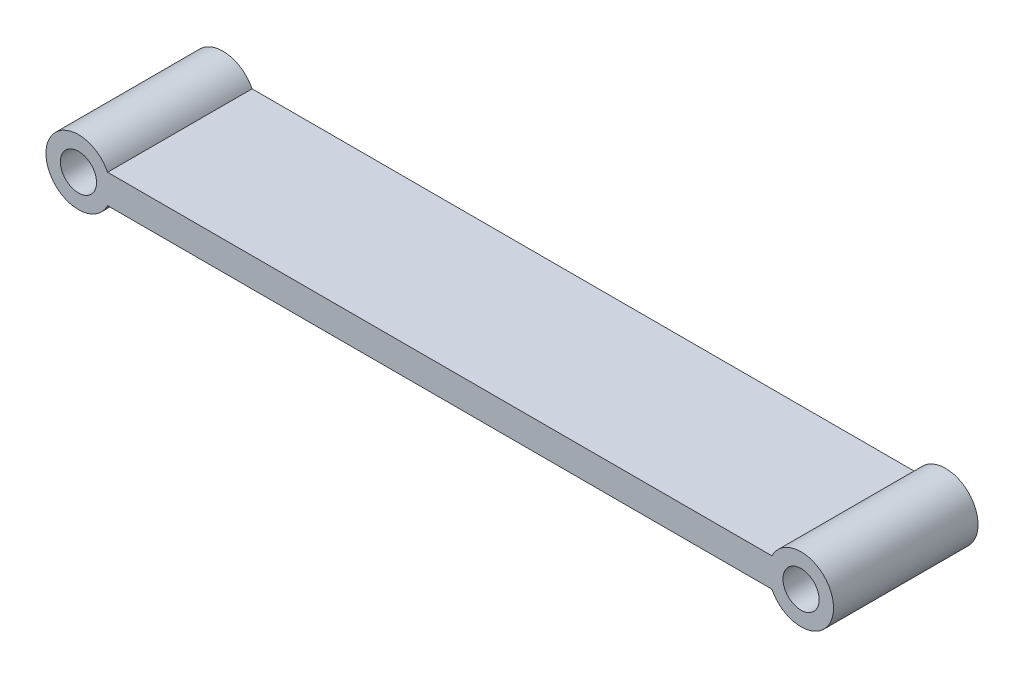
ISO-10303-21;
HEADER;
FILE_DESCRIPTION(('STEP AP214'),'2;1');
FILE_NAME('part.step','',(''),(''),'','','');
FILE_SCHEMA(('AUTOMOTIVE_DESIGN { 1 0 10303 214 1 1 1 1 }'));
ENDSEC;
DATA;
#1=APPLICATION_CONTEXT('core data for automotive mechanical design processes');
#2=APPLICATION_PROTOCOL_DEFINITION('international standard','automotive_design',2000,#1);
#3=PRODUCT_CONTEXT('',#1,'mechanical');
#4=PRODUCT('Part','Part','',(#3));
#5=PRODUCT_RELATED_PRODUCT_CATEGORY('part','',(#4));
#6=PRODUCT_DEFINITION_FORMATION('','',#4);
#7=PRODUCT_DEFINITION_CONTEXT('part definition',#1,'design');
#8=PRODUCT_DEFINITION('design','',#6,#7);
#9=PRODUCT_DEFINITION_SHAPE('','',#8);
#10=(LENGTH_UNIT() NAMED_UNIT(*) SI_UNIT(.MILLI.,.METRE.));
#11=(NAMED_UNIT(*) PLANE_ANGLE_UNIT() SI_UNIT($,.RADIAN.));
#12=(NAMED_UNIT(*) SI_UNIT($,.STERADIAN.) SOLID_ANGLE_UNIT());
#13=UNCERTAINTY_MEASURE_WITH_UNIT(LENGTH_MEASURE(1.E-05),#10,'distance_accuracy_value','');
#14=(GEOMETRIC_REPRESENTATION_CONTEXT(3) GLOBAL_UNCERTAINTY_ASSIGNED_CONTEXT((#13)) GLOBAL_UNIT_ASSIGNED_CONTEXT((#10,
#11,#12)) REPRESENTATION_CONTEXT('',''));
#15=CARTESIAN_POINT('',(0.,0.,0.));
#16=DIRECTION('',(0.,0.,1.));
#17=DIRECTION('',(1.,0.,0.));
#18=AXIS2_PLACEMENT_3D('',#15,#16,#17);
#19=CARTESIAN_POINT('',(0.,0.,12.7));
#20=DIRECTION('',(0.,0.,1.));
#21=DIRECTION('',(1.,0.,0.));
#22=AXIS2_PLACEMENT_3D('',#19,#20,#21);
#23=PLANE('',#22);
#24=CARTESIAN_POINT('',(0.,0.,12.7));
#25=DIRECTION('',(0.,0.,1.));
#26=DIRECTION('',(1.,0.,0.));
#27=AXIS2_PLACEMENT_3D('',#24,#25,#26);
#28=CIRCLE('',#27,3.175);
#29=CARTESIAN_POINT('',(3.175,0.,12.7));
#30=VERTEX_POINT('',#29);
#31=EDGE_CURVE('E100',#30,#30,#28,.T.);
#32=ORIENTED_EDGE('',*,*,#31,.F.);
#33=EDGE_LOOP('',(#32));
#34=FACE_BOUND('',#33,.T.);
#35=CARTESIAN_POINT('',(0.,0.,12.7));
#36=DIRECTION('',(0.,0.,1.));
#37=DIRECTION('',(1.,0.,0.));
#38=AXIS2_PLACEMENT_3D('',#35,#36,#37);
#39=CIRCLE('',#38,5.715);
#40=CARTESIAN_POINT('',(5.11953367016958,2.54,12.7));
#41=VERTEX_POINT('',#40);
#42=CARTESIAN_POINT('',(5.11953367016958,-2.54,12.7));
#43=VERTEX_POINT('',#42);
#44=EDGE_CURVE('E85',#41,#43,#39,.T.);
#45=ORIENTED_EDGE('',*,*,#44,.T.);
#46=DIRECTION('',(1.,0.,0.));
#47=VECTOR('',#46,1.);
#48=CARTESIAN_POINT('',(5.11953367016958,-2.54,12.7));
#49=LINE('',#48,#47);
#50=CARTESIAN_POINT('',(121.88046632983,-2.54,12.7));
#51=VERTEX_POINT('',#50);
#52=EDGE_CURVE('E80',#43,#51,#49,.T.);
#53=ORIENTED_EDGE('',*,*,#52,.T.);
#54=CARTESIAN_POINT('',(127.,0.,12.7));
#55=DIRECTION('',(0.,0.,1.));
#56=DIRECTION('',(1.,0.,0.));
#57=AXIS2_PLACEMENT_3D('',#54,#55,#56);
#58=CIRCLE('',#57,5.715);
#59=CARTESIAN_POINT('',(121.88046632983,2.54,12.7));
#60=VERTEX_POINT('',#59);
#61=EDGE_CURVE('E83',#51,#60,#58,.T.);
#62=ORIENTED_EDGE('',*,*,#61,.T.);
#63=DIRECTION('',(-1.,0.,0.));
#64=VECTOR('',#63,1.);
#65=CARTESIAN_POINT('',(5.11953367016958,2.54,12.7));
#66=LINE('',#65,#64);
#67=EDGE_CURVE('E50',#60,#41,#66,.T.);
#68=ORIENTED_EDGE('',*,*,#67,.T.);
#69=EDGE_LOOP('',(#45,#53,#62,#68));
#70=FACE_BOUND('',#69,.T.);
#71=CARTESIAN_POINT('',(127.,0.,12.7));
#72=DIRECTION('',(0.,0.,1.));
#73=DIRECTION('',(1.,0.,0.));
#74=AXIS2_PLACEMENT_3D('',#71,#72,#73);
#75=CIRCLE('',#74,3.175);
#76=CARTESIAN_POINT('',(130.175,0.,12.7));
#77=VERTEX_POINT('',#76);
#78=EDGE_CURVE('E115',#77,#77,#75,.T.);
#79=ORIENTED_EDGE('',*,*,#78,.F.);
#80=EDGE_LOOP('',(#79));
#81=FACE_BOUND('',#80,.T.);
#82=ADVANCED_FACE('F33',(#34,#70,#81),#23,.T.);
#83=CARTESIAN_POINT('',(0.,0.,-12.7));
#84=DIRECTION('',(0.,0.,1.));
#85=DIRECTION('',(1.,0.,0.));
#86=AXIS2_PLACEMENT_3D('',#83,#84,#85);
#87=PLANE('',#86);
#88=CARTESIAN_POINT('',(0.,0.,-12.7));
#89=DIRECTION('',(0.,0.,1.));
#90=DIRECTION('',(1.,0.,0.));
#91=AXIS2_PLACEMENT_3D('',#88,#89,#90);
#92=CIRCLE('',#91,5.715);
#93=CARTESIAN_POINT('',(5.11953367016958,2.54,-12.7));
#94=VERTEX_POINT('',#93);
#95=CARTESIAN_POINT('',(5.11953367016958,-2.54,-12.7));
#96=VERTEX_POINT('',#95);
#97=EDGE_CURVE('E97',#94,#96,#92,.T.);
#98=ORIENTED_EDGE('',*,*,#97,.F.);
#99=DIRECTION('',(-1.,0.,0.));
#100=VECTOR('',#99,1.);
#101=CARTESIAN_POINT('',(5.11953367016958,2.54,-12.7));
#102=LINE('',#101,#100);
#103=CARTESIAN_POINT('',(121.88046632983,2.54,-12.7));
#104=VERTEX_POINT('',#103);
#105=EDGE_CURVE('E73',#104,#94,#102,.T.);
#106=ORIENTED_EDGE('',*,*,#105,.F.);
#107=CARTESIAN_POINT('',(127.,0.,-12.7));
#108=DIRECTION('',(0.,0.,1.));
#109=DIRECTION('',(1.,0.,0.));
#110=AXIS2_PLACEMENT_3D('',#107,#108,#109);
#111=CIRCLE('',#110,5.715);
#112=CARTESIAN_POINT('',(121.88046632983,-2.54,-12.7));
#113=VERTEX_POINT('',#112);
#114=EDGE_CURVE('E67',#113,#104,#111,.T.);
#115=ORIENTED_EDGE('',*,*,#114,.F.);
#116=DIRECTION('',(1.,0.,0.));
#117=VECTOR('',#116,1.);
#118=CARTESIAN_POINT('',(5.11953367016958,-2.54,-12.7));
#119=LINE('',#118,#117);
#120=EDGE_CURVE('E89',#96,#113,#119,.T.);
#121=ORIENTED_EDGE('',*,*,#120,.F.);
#122=EDGE_LOOP('',(#98,#106,#115,#121));
#123=FACE_BOUND('',#122,.T.);
#124=CARTESIAN_POINT('',(0.,0.,-12.7));
#125=DIRECTION('',(0.,0.,1.));
#126=DIRECTION('',(1.,0.,0.));
#127=AXIS2_PLACEMENT_3D('',#124,#125,#126);
#128=CIRCLE('',#127,3.175);
#129=CARTESIAN_POINT('',(3.175,0.,-12.7));
#130=VERTEX_POINT('',#129);
#131=EDGE_CURVE('E112',#130,#130,#128,.T.);
#132=ORIENTED_EDGE('',*,*,#131,.T.);
#133=EDGE_LOOP('',(#132));
#134=FACE_BOUND('',#133,.T.);
#135=CARTESIAN_POINT('',(127.,0.,-12.7));
#136=DIRECTION('',(0.,0.,1.));
#137=DIRECTION('',(1.,0.,0.));
#138=AXIS2_PLACEMENT_3D('',#135,#136,#137);
#139=CIRCLE('',#138,3.175);
#140=CARTESIAN_POINT('',(130.175,0.,-12.7));
#141=VERTEX_POINT('',#140);
#142=EDGE_CURVE('E118',#141,#141,#139,.T.);
#143=ORIENTED_EDGE('',*,*,#142,.T.);
#144=EDGE_LOOP('',(#143));
#145=FACE_BOUND('',#144,.T.);
#146=ADVANCED_FACE('F108',(#123,#134,#145),#87,.F.);
#147=CARTESIAN_POINT('',(0.,0.,12.7));
#148=DIRECTION('',(0.,0.,-1.));
#149=DIRECTION('',(-1.,0.,0.));
#150=AXIS2_PLACEMENT_3D('',#147,#148,#149);
#151=CYLINDRICAL_SURFACE('',#150,5.715);
#152=ORIENTED_EDGE('',*,*,#97,.T.);
#153=DIRECTION('',(0.,0.,-1.));
#154=VECTOR('',#153,1.);
#155=CARTESIAN_POINT('',(5.11953367016958,-2.54,12.7));
#156=LINE('',#155,#154);
#157=EDGE_CURVE('E11',#43,#96,#156,.T.);
#158=ORIENTED_EDGE('',*,*,#157,.F.);
#159=ORIENTED_EDGE('',*,*,#44,.F.);
#160=DIRECTION('',(0.,0.,-1.));
#161=VECTOR('',#160,1.);
#162=CARTESIAN_POINT('',(5.11953367016958,2.54,12.7));
#163=LINE('',#162,#161);
#164=EDGE_CURVE('E93',#41,#94,#163,.T.);
#165=ORIENTED_EDGE('',*,*,#164,.T.);
#166=EDGE_LOOP('',(#152,#158,#159,#165));
#167=FACE_BOUND('',#166,.T.);
#168=ADVANCED_FACE('F35',(#167),#151,.T.);
#169=CARTESIAN_POINT('',(5.11953367016958,-2.54,12.7));
#170=DIRECTION('',(0.,1.,0.));
#171=DIRECTION('',(0.,0.,1.));
#172=AXIS2_PLACEMENT_3D('',#169,#170,#171);
#173=PLANE('',#172);
#174=ORIENTED_EDGE('',*,*,#120,.T.);
#175=DIRECTION('',(0.,0.,-1.));
#176=VECTOR('',#175,1.);
#177=CARTESIAN_POINT('',(121.88046632983,-2.54,12.7));
#178=LINE('',#177,#176);
#179=EDGE_CURVE('E42',#51,#113,#178,.T.);
#180=ORIENTED_EDGE('',*,*,#179,.F.);
#181=ORIENTED_EDGE('',*,*,#52,.F.);
#182=ORIENTED_EDGE('',*,*,#157,.T.);
#183=EDGE_LOOP('',(#174,#180,#181,#182));
#184=FACE_BOUND('',#183,.T.);
#185=ADVANCED_FACE('F88',(#184),#173,.F.);
#186=CARTESIAN_POINT('',(127.,0.,12.7));
#187=DIRECTION('',(0.,0.,-1.));
#188=DIRECTION('',(-1.,0.,0.));
#189=AXIS2_PLACEMENT_3D('',#186,#187,#188);
#190=CYLINDRICAL_SURFACE('',#189,5.715);
#191=ORIENTED_EDGE('',*,*,#114,.T.);
#192=DIRECTION('',(0.,0.,-1.));
#193=VECTOR('',#192,1.);
#194=CARTESIAN_POINT('',(121.88046632983,2.54,12.7));
#195=LINE('',#194,#193);
#196=EDGE_CURVE('E90',#60,#104,#195,.T.);
#197=ORIENTED_EDGE('',*,*,#196,.F.);
#198=ORIENTED_EDGE('',*,*,#61,.F.);
#199=ORIENTED_EDGE('',*,*,#179,.T.);
#200=EDGE_LOOP('',(#191,#197,#198,#199));
#201=FACE_BOUND('',#200,.T.);
#202=ADVANCED_FACE('F91',(#201),#190,.T.);
#203=CARTESIAN_POINT('',(5.11953367016958,2.54,12.7));
#204=DIRECTION('',(0.,-1.,0.));
#205=DIRECTION('',(0.,0.,-1.));
#206=AXIS2_PLACEMENT_3D('',#203,#204,#205);
#207=PLANE('',#206);
#208=ORIENTED_EDGE('',*,*,#105,.T.);
#209=ORIENTED_EDGE('',*,*,#164,.F.);
#210=ORIENTED_EDGE('',*,*,#67,.F.);
#211=ORIENTED_EDGE('',*,*,#196,.T.);
#212=EDGE_LOOP('',(#208,#209,#210,#211));
#213=FACE_BOUND('',#212,.T.);
#214=ADVANCED_FACE('F105',(#213),#207,.F.);
#215=CARTESIAN_POINT('',(0.,0.,12.7));
#216=DIRECTION('',(0.,0.,-1.));
#217=DIRECTION('',(-1.,0.,0.));
#218=AXIS2_PLACEMENT_3D('',#215,#216,#217);
#219=CYLINDRICAL_SURFACE('',#218,3.175);
#220=ORIENTED_EDGE('',*,*,#31,.T.);
#221=EDGE_LOOP('',(#220));
#222=FACE_BOUND('',#221,.T.);
#223=ORIENTED_EDGE('',*,*,#131,.F.);
#224=EDGE_LOOP('',(#223));
#225=FACE_BOUND('',#224,.T.);
#226=ADVANCED_FACE('F135',(#222,#225),#219,.F.);
#227=CARTESIAN_POINT('',(127.,0.,12.7));
#228=DIRECTION('',(0.,0.,-1.));
#229=DIRECTION('',(-1.,0.,0.));
#230=AXIS2_PLACEMENT_3D('',#227,#228,#229);
#231=CYLINDRICAL_SURFACE('',#230,3.175);
#232=ORIENTED_EDGE('',*,*,#78,.T.);
#233=EDGE_LOOP('',(#232));
#234=FACE_BOUND('',#233,.T.);
#235=ORIENTED_EDGE('',*,*,#142,.F.);
#236=EDGE_LOOP('',(#235));
#237=FACE_BOUND('',#236,.T.);
#238=ADVANCED_FACE('F124',(#234,#237),#231,.F.);
#239=CLOSED_SHELL('',(#82,#146,#168,#185,#202,#214,#226,#238));
#240=MANIFOLD_SOLID_BREP('B2',#239);
#241=ADVANCED_BREP_SHAPE_REPRESENTATION('',(#18,#240),#14);
#242=SHAPE_DEFINITION_REPRESENTATION(#9,#241);
ENDSEC;
END-ISO-10303-21;
